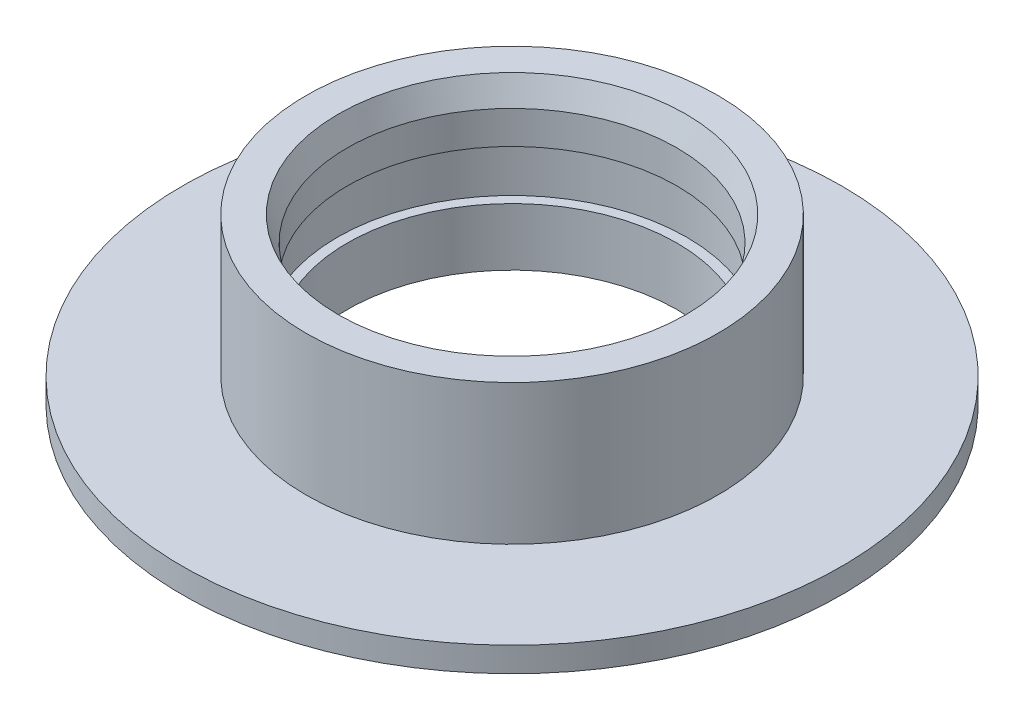
ISO-10303-21;
HEADER;
FILE_DESCRIPTION(('STEP AP214'),'2;1');
FILE_NAME('part.step','',(''),(''),'','','');
FILE_SCHEMA(('AUTOMOTIVE_DESIGN { 1 0 10303 214 1 1 1 1 }'));
ENDSEC;
DATA;
#1=APPLICATION_CONTEXT('core data for automotive mechanical design processes');
#2=APPLICATION_PROTOCOL_DEFINITION('international standard','automotive_design',2000,#1);
#3=PRODUCT_CONTEXT('',#1,'mechanical');
#4=PRODUCT('Part','Part','',(#3));
#5=PRODUCT_RELATED_PRODUCT_CATEGORY('part','',(#4));
#6=PRODUCT_DEFINITION_FORMATION('','',#4);
#7=PRODUCT_DEFINITION_CONTEXT('part definition',#1,'design');
#8=PRODUCT_DEFINITION('design','',#6,#7);
#9=PRODUCT_DEFINITION_SHAPE('','',#8);
#10=(LENGTH_UNIT() NAMED_UNIT(*) SI_UNIT(.MILLI.,.METRE.));
#11=(NAMED_UNIT(*) PLANE_ANGLE_UNIT() SI_UNIT($,.RADIAN.));
#12=(NAMED_UNIT(*) SI_UNIT($,.STERADIAN.) SOLID_ANGLE_UNIT());
#13=UNCERTAINTY_MEASURE_WITH_UNIT(LENGTH_MEASURE(1.E-05),#10,'distance_accuracy_value','');
#14=(GEOMETRIC_REPRESENTATION_CONTEXT(3) GLOBAL_UNCERTAINTY_ASSIGNED_CONTEXT((#13)) GLOBAL_UNIT_ASSIGNED_CONTEXT((#10,
#11,#12)) REPRESENTATION_CONTEXT('',''));
#15=CARTESIAN_POINT('',(0.,0.,0.));
#16=DIRECTION('',(0.,0.,1.));
#17=DIRECTION('',(1.,0.,0.));
#18=AXIS2_PLACEMENT_3D('',#15,#16,#17);
#19=CARTESIAN_POINT('',(200.,0.,0.));
#20=DIRECTION('',(0.,-1.,0.));
#21=DIRECTION('',(0.,0.,-1.));
#22=AXIS2_PLACEMENT_3D('',#19,#20,#21);
#23=PLANE('',#22);
#24=CARTESIAN_POINT('',(0.,0.,0.));
#25=DIRECTION('',(0.,-1.,0.));
#26=DIRECTION('',(0.,0.,-1.));
#27=AXIS2_PLACEMENT_3D('',#24,#25,#26);
#28=CIRCLE('',#27,200.);
#29=CARTESIAN_POINT('',(0.,0.,-200.));
#30=VERTEX_POINT('',#29);
#31=EDGE_CURVE('E68',#30,#30,#28,.T.);
#32=ORIENTED_EDGE('',*,*,#31,.T.);
#33=EDGE_LOOP('',(#32));
#34=FACE_BOUND('',#33,.T.);
#35=CARTESIAN_POINT('',(0.,0.,0.));
#36=DIRECTION('',(0.,-1.,0.));
#37=DIRECTION('',(0.,0.,-1.));
#38=AXIS2_PLACEMENT_3D('',#35,#36,#37);
#39=CIRCLE('',#38,100.);
#40=CARTESIAN_POINT('',(0.,0.,-100.));
#41=VERTEX_POINT('',#40);
#42=EDGE_CURVE('E10',#41,#41,#39,.T.);
#43=ORIENTED_EDGE('',*,*,#42,.F.);
#44=EDGE_LOOP('',(#43));
#45=FACE_BOUND('',#44,.T.);
#46=ADVANCED_FACE('F31',(#34,#45),#23,.T.);
#47=CARTESIAN_POINT('',(0.,0.,0.));
#48=DIRECTION('',(0.,-1.,0.));
#49=DIRECTION('',(0.,0.,-1.));
#50=AXIS2_PLACEMENT_3D('',#47,#48,#49);
#51=CYLINDRICAL_SURFACE('',#50,100.);
#52=ORIENTED_EDGE('',*,*,#42,.T.);
#53=EDGE_LOOP('',(#52));
#54=FACE_BOUND('',#53,.T.);
#55=CARTESIAN_POINT('',(0.,35.,0.));
#56=DIRECTION('',(0.,-1.,0.));
#57=DIRECTION('',(0.,0.,-1.));
#58=AXIS2_PLACEMENT_3D('',#55,#56,#57);
#59=CIRCLE('',#58,100.);
#60=CARTESIAN_POINT('',(0.,35.,-100.));
#61=VERTEX_POINT('',#60);
#62=EDGE_CURVE('E37',#61,#61,#59,.T.);
#63=ORIENTED_EDGE('',*,*,#62,.F.);
#64=EDGE_LOOP('',(#63));
#65=FACE_BOUND('',#64,.T.);
#66=ADVANCED_FACE('F86',(#54,#65),#51,.F.);
#67=CARTESIAN_POINT('',(106.,35.,0.));
#68=DIRECTION('',(0.,1.,0.));
#69=DIRECTION('',(0.,0.,1.));
#70=AXIS2_PLACEMENT_3D('',#67,#68,#69);
#71=PLANE('',#70);
#72=ORIENTED_EDGE('',*,*,#62,.T.);
#73=EDGE_LOOP('',(#72));
#74=FACE_BOUND('',#73,.T.);
#75=CARTESIAN_POINT('',(0.,35.,0.));
#76=DIRECTION('',(0.,-1.,0.));
#77=DIRECTION('',(0.,0.,-1.));
#78=AXIS2_PLACEMENT_3D('',#75,#76,#77);
#79=CIRCLE('',#78,106.);
#80=CARTESIAN_POINT('',(0.,35.,-106.));
#81=VERTEX_POINT('',#80);
#82=EDGE_CURVE('E41',#81,#81,#79,.T.);
#83=ORIENTED_EDGE('',*,*,#82,.F.);
#84=EDGE_LOOP('',(#83));
#85=FACE_BOUND('',#84,.T.);
#86=ADVANCED_FACE('F90',(#74,#85),#71,.T.);
#87=CARTESIAN_POINT('',(0.,0.,0.));
#88=DIRECTION('',(0.,-1.,0.));
#89=DIRECTION('',(0.,0.,-1.));
#90=AXIS2_PLACEMENT_3D('',#87,#88,#89);
#91=CYLINDRICAL_SURFACE('',#90,106.);
#92=ORIENTED_EDGE('',*,*,#82,.T.);
#93=EDGE_LOOP('',(#92));
#94=FACE_BOUND('',#93,.T.);
#95=CARTESIAN_POINT('',(0.,65.,0.));
#96=DIRECTION('',(0.,-1.,0.));
#97=DIRECTION('',(0.,0.,-1.));
#98=AXIS2_PLACEMENT_3D('',#95,#96,#97);
#99=CIRCLE('',#98,106.);
#100=CARTESIAN_POINT('',(0.,65.,-106.));
#101=VERTEX_POINT('',#100);
#102=EDGE_CURVE('E45',#101,#101,#99,.T.);
#103=ORIENTED_EDGE('',*,*,#102,.F.);
#104=EDGE_LOOP('',(#103));
#105=FACE_BOUND('',#104,.T.);
#106=ADVANCED_FACE('F94',(#94,#105),#91,.F.);
#107=CARTESIAN_POINT('',(100.,65.,0.));
#108=DIRECTION('',(0.,-1.,0.));
#109=DIRECTION('',(0.,0.,-1.));
#110=AXIS2_PLACEMENT_3D('',#107,#108,#109);
#111=PLANE('',#110);
#112=ORIENTED_EDGE('',*,*,#102,.T.);
#113=EDGE_LOOP('',(#112));
#114=FACE_BOUND('',#113,.T.);
#115=CARTESIAN_POINT('',(0.,65.,0.));
#116=DIRECTION('',(0.,-1.,0.));
#117=DIRECTION('',(0.,0.,-1.));
#118=AXIS2_PLACEMENT_3D('',#115,#116,#117);
#119=CIRCLE('',#118,100.);
#120=CARTESIAN_POINT('',(0.,65.,-100.));
#121=VERTEX_POINT('',#120);
#122=EDGE_CURVE('E50',#121,#121,#119,.T.);
#123=ORIENTED_EDGE('',*,*,#122,.F.);
#124=EDGE_LOOP('',(#123));
#125=FACE_BOUND('',#124,.T.);
#126=ADVANCED_FACE('F100',(#114,#125),#111,.T.);
#127=CARTESIAN_POINT('',(0.,0.,0.));
#128=DIRECTION('',(0.,-1.,0.));
#129=DIRECTION('',(0.,0.,-1.));
#130=AXIS2_PLACEMENT_3D('',#127,#128,#129);
#131=CYLINDRICAL_SURFACE('',#130,100.);
#132=ORIENTED_EDGE('',*,*,#122,.T.);
#133=EDGE_LOOP('',(#132));
#134=FACE_BOUND('',#133,.T.);
#135=CARTESIAN_POINT('',(0.,85.,0.));
#136=DIRECTION('',(0.,-1.,0.));
#137=DIRECTION('',(0.,0.,-1.));
#138=AXIS2_PLACEMENT_3D('',#135,#136,#137);
#139=CIRCLE('',#138,100.);
#140=CARTESIAN_POINT('',(0.,85.,-100.));
#141=VERTEX_POINT('',#140);
#142=EDGE_CURVE('E53',#141,#141,#139,.T.);
#143=ORIENTED_EDGE('',*,*,#142,.F.);
#144=EDGE_LOOP('',(#143));
#145=FACE_BOUND('',#144,.T.);
#146=ADVANCED_FACE('F104',(#134,#145),#131,.F.);
#147=CARTESIAN_POINT('',(0.,100.,0.));
#148=DIRECTION('',(0.,1.,0.));
#149=DIRECTION('',(0.,0.,1.));
#150=AXIS2_PLACEMENT_3D('',#147,#148,#149);
#151=CONICAL_SURFACE('',#150,105.459553513993,0.349065850398867);
#152=ORIENTED_EDGE('',*,*,#142,.T.);
#153=EDGE_LOOP('',(#152));
#154=FACE_BOUND('',#153,.T.);
#155=CARTESIAN_POINT('',(0.,100.,0.));
#156=DIRECTION('',(0.,-1.,0.));
#157=DIRECTION('',(0.,0.,-1.));
#158=AXIS2_PLACEMENT_3D('',#155,#156,#157);
#159=CIRCLE('',#158,105.459553513993);
#160=CARTESIAN_POINT('',(0.,100.,-105.459553513993));
#161=VERTEX_POINT('',#160);
#162=EDGE_CURVE('E56',#161,#161,#159,.T.);
#163=ORIENTED_EDGE('',*,*,#162,.F.);
#164=EDGE_LOOP('',(#163));
#165=FACE_BOUND('',#164,.T.);
#166=ADVANCED_FACE('F108',(#154,#165),#151,.F.);
#167=CARTESIAN_POINT('',(105.459553513993,100.,0.));
#168=DIRECTION('',(0.,1.,0.));
#169=DIRECTION('',(0.,0.,1.));
#170=AXIS2_PLACEMENT_3D('',#167,#168,#169);
#171=PLANE('',#170);
#172=ORIENTED_EDGE('',*,*,#162,.T.);
#173=EDGE_LOOP('',(#172));
#174=FACE_BOUND('',#173,.T.);
#175=CARTESIAN_POINT('',(0.,100.,0.));
#176=DIRECTION('',(0.,-1.,0.));
#177=DIRECTION('',(0.,0.,-1.));
#178=AXIS2_PLACEMENT_3D('',#175,#176,#177);
#179=CIRCLE('',#178,125.);
#180=CARTESIAN_POINT('',(0.,100.,-125.));
#181=VERTEX_POINT('',#180);
#182=EDGE_CURVE('E59',#181,#181,#179,.T.);
#183=ORIENTED_EDGE('',*,*,#182,.F.);
#184=EDGE_LOOP('',(#183));
#185=FACE_BOUND('',#184,.T.);
#186=ADVANCED_FACE('F112',(#174,#185),#171,.T.);
#187=CARTESIAN_POINT('',(0.,0.,0.));
#188=DIRECTION('',(0.,-1.,0.));
#189=DIRECTION('',(0.,0.,-1.));
#190=AXIS2_PLACEMENT_3D('',#187,#188,#189);
#191=CYLINDRICAL_SURFACE('',#190,125.);
#192=ORIENTED_EDGE('',*,*,#182,.T.);
#193=EDGE_LOOP('',(#192));
#194=FACE_BOUND('',#193,.T.);
#195=CARTESIAN_POINT('',(0.,15.,0.));
#196=DIRECTION('',(0.,-1.,0.));
#197=DIRECTION('',(0.,0.,-1.));
#198=AXIS2_PLACEMENT_3D('',#195,#196,#197);
#199=CIRCLE('',#198,125.);
#200=CARTESIAN_POINT('',(0.,15.,-125.));
#201=VERTEX_POINT('',#200);
#202=EDGE_CURVE('E62',#201,#201,#199,.T.);
#203=ORIENTED_EDGE('',*,*,#202,.F.);
#204=EDGE_LOOP('',(#203));
#205=FACE_BOUND('',#204,.T.);
#206=ADVANCED_FACE('F82',(#194,#205),#191,.T.);
#207=CARTESIAN_POINT('',(125.,15.,0.));
#208=DIRECTION('',(0.,1.,0.));
#209=DIRECTION('',(0.,0.,1.));
#210=AXIS2_PLACEMENT_3D('',#207,#208,#209);
#211=PLANE('',#210);
#212=ORIENTED_EDGE('',*,*,#202,.T.);
#213=EDGE_LOOP('',(#212));
#214=FACE_BOUND('',#213,.T.);
#215=CARTESIAN_POINT('',(0.,15.,0.));
#216=DIRECTION('',(0.,-1.,0.));
#217=DIRECTION('',(0.,0.,-1.));
#218=AXIS2_PLACEMENT_3D('',#215,#216,#217);
#219=CIRCLE('',#218,200.);
#220=CARTESIAN_POINT('',(0.,15.,-200.));
#221=VERTEX_POINT('',#220);
#222=EDGE_CURVE('E65',#221,#221,#219,.T.);
#223=ORIENTED_EDGE('',*,*,#222,.F.);
#224=EDGE_LOOP('',(#223));
#225=FACE_BOUND('',#224,.T.);
#226=ADVANCED_FACE('F76',(#214,#225),#211,.T.);
#227=CARTESIAN_POINT('',(0.,0.,0.));
#228=DIRECTION('',(0.,-1.,0.));
#229=DIRECTION('',(0.,0.,-1.));
#230=AXIS2_PLACEMENT_3D('',#227,#228,#229);
#231=CYLINDRICAL_SURFACE('',#230,200.);
#232=ORIENTED_EDGE('',*,*,#222,.T.);
#233=EDGE_LOOP('',(#232));
#234=FACE_BOUND('',#233,.T.);
#235=ORIENTED_EDGE('',*,*,#31,.F.);
#236=EDGE_LOOP('',(#235));
#237=FACE_BOUND('',#236,.T.);
#238=ADVANCED_FACE('F74',(#234,#237),#231,.T.);
#239=CLOSED_SHELL('',(#46,#66,#86,#106,#126,#146,#166,#186,#206,#226,#238));
#240=MANIFOLD_SOLID_BREP('B2',#239);
#241=ADVANCED_BREP_SHAPE_REPRESENTATION('',(#18,#240),#14);
#242=SHAPE_DEFINITION_REPRESENTATION(#9,#241);
ENDSEC;
END-ISO-10303-21;
